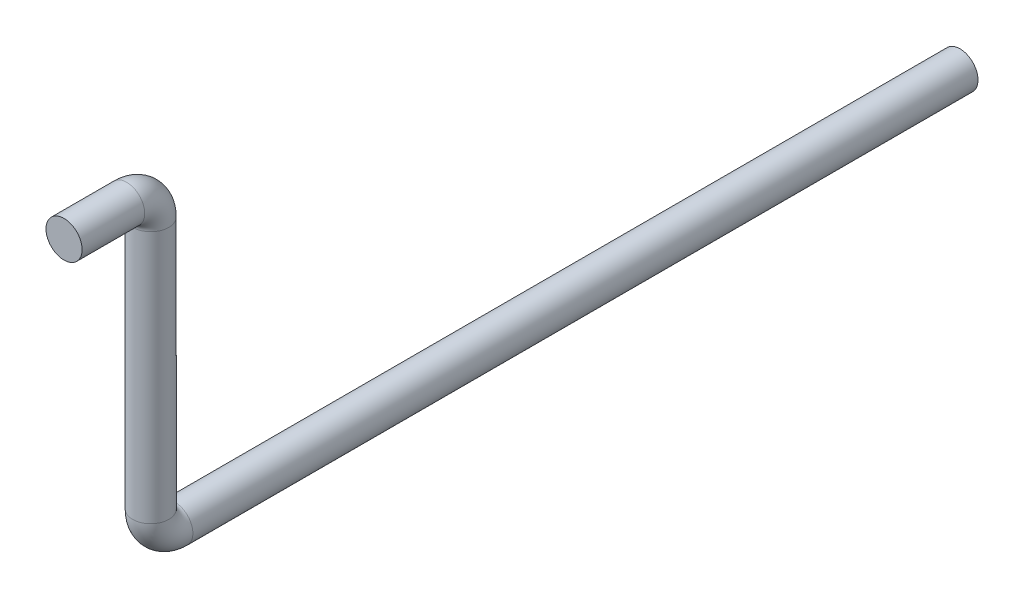
ISO-10303-21;
HEADER;
FILE_DESCRIPTION(('STEP AP214'),'2;1');
FILE_NAME('part.step','',(''),(''),'','','');
FILE_SCHEMA(('AUTOMOTIVE_DESIGN { 1 0 10303 214 1 1 1 1 }'));
ENDSEC;
DATA;
#1=APPLICATION_CONTEXT('core data for automotive mechanical design processes');
#2=APPLICATION_PROTOCOL_DEFINITION('international standard','automotive_design',2000,#1);
#3=PRODUCT_CONTEXT('',#1,'mechanical');
#4=PRODUCT('Part','Part','',(#3));
#5=PRODUCT_RELATED_PRODUCT_CATEGORY('part','',(#4));
#6=PRODUCT_DEFINITION_FORMATION('','',#4);
#7=PRODUCT_DEFINITION_CONTEXT('part definition',#1,'design');
#8=PRODUCT_DEFINITION('design','',#6,#7);
#9=PRODUCT_DEFINITION_SHAPE('','',#8);
#10=(LENGTH_UNIT() NAMED_UNIT(*) SI_UNIT(.MILLI.,.METRE.));
#11=(NAMED_UNIT(*) PLANE_ANGLE_UNIT() SI_UNIT($,.RADIAN.));
#12=(NAMED_UNIT(*) SI_UNIT($,.STERADIAN.) SOLID_ANGLE_UNIT());
#13=UNCERTAINTY_MEASURE_WITH_UNIT(LENGTH_MEASURE(1.E-05),#10,'distance_accuracy_value','');
#14=(GEOMETRIC_REPRESENTATION_CONTEXT(3) GLOBAL_UNCERTAINTY_ASSIGNED_CONTEXT((#13)) GLOBAL_UNIT_ASSIGNED_CONTEXT((#10,
#11,#12)) REPRESENTATION_CONTEXT('',''));
#15=CARTESIAN_POINT('',(0.,0.,0.));
#16=DIRECTION('',(0.,0.,1.));
#17=DIRECTION('',(1.,0.,0.));
#18=AXIS2_PLACEMENT_3D('',#15,#16,#17);
#19=CARTESIAN_POINT('',(4.69383318185996,140.15147983338,72.));
#20=DIRECTION('',(0.,0.,1.));
#21=DIRECTION('',(1.,0.,0.));
#22=AXIS2_PLACEMENT_3D('',#19,#20,#21);
#23=PLANE('',#22);
#24=CARTESIAN_POINT('',(4.69383318185996,140.15147983338,72.));
#25=DIRECTION('',(0.,0.,1.));
#26=DIRECTION('',(1.,0.,0.));
#27=AXIS2_PLACEMENT_3D('',#24,#25,#26);
#28=CIRCLE('',#27,7.5);
#29=CARTESIAN_POINT('',(12.19383318186,140.15147983338,72.));
#30=VERTEX_POINT('',#29);
#31=EDGE_CURVE('E11',#30,#30,#28,.T.);
#32=ORIENTED_EDGE('',*,*,#31,.T.);
#33=EDGE_LOOP('',(#32));
#34=FACE_BOUND('',#33,.T.);
#35=ADVANCED_FACE('F33',(#34),#23,.T.);
#36=CARTESIAN_POINT('',(4.69383318185996,15.1514798333803,0.));
#37=DIRECTION('',(0.,0.,1.));
#38=DIRECTION('',(1.,0.,0.));
#39=AXIS2_PLACEMENT_3D('',#36,#37,#38);
#40=CYLINDRICAL_SURFACE('',#39,7.5);
#41=CARTESIAN_POINT('',(4.69383318185996,15.1514798333803,26.));
#42=DIRECTION('',(0.,0.,1.));
#43=DIRECTION('',(1.,0.,0.));
#44=AXIS2_PLACEMENT_3D('',#41,#42,#43);
#45=CIRCLE('',#44,7.5);
#46=CARTESIAN_POINT('',(4.69383318185996,7.65147983338034,26.));
#47=VERTEX_POINT('',#46);
#48=EDGE_CURVE('E58',#47,#47,#45,.T.);
#49=ORIENTED_EDGE('',*,*,#48,.F.);
#50=EDGE_LOOP('',(#49));
#51=FACE_BOUND('',#50,.T.);
#52=CARTESIAN_POINT('',(4.69383318185996,15.1514798333803,-300.));
#53=DIRECTION('',(0.,0.,-1.));
#54=DIRECTION('',(-1.,0.,0.));
#55=AXIS2_PLACEMENT_3D('',#52,#53,#54);
#56=CIRCLE('',#55,7.5);
#57=CARTESIAN_POINT('',(-2.80616681814004,15.1514798333803,-300.));
#58=VERTEX_POINT('',#57);
#59=EDGE_CURVE('E61',#58,#58,#56,.T.);
#60=ORIENTED_EDGE('',*,*,#59,.F.);
#61=EDGE_LOOP('',(#60));
#62=FACE_BOUND('',#61,.T.);
#63=ADVANCED_FACE('F66',(#51,#62),#40,.T.);
#64=CARTESIAN_POINT('',(4.69383318185996,25.1514798333803,26.));
#65=DIRECTION('',(-1.,0.,0.));
#66=DIRECTION('',(0.,0.,1.));
#67=AXIS2_PLACEMENT_3D('',#64,#65,#66);
#68=TOROIDAL_SURFACE('',#67,10.,7.5);
#69=CARTESIAN_POINT('',(4.69383318185996,25.1514798333803,36.));
#70=DIRECTION('',(0.,1.,0.));
#71=DIRECTION('',(1.,0.,0.));
#72=AXIS2_PLACEMENT_3D('',#69,#70,#71);
#73=CIRCLE('',#72,7.5);
#74=CARTESIAN_POINT('',(4.69383318185996,25.1514798333803,43.5));
#75=VERTEX_POINT('',#74);
#76=EDGE_CURVE('E53',#75,#75,#73,.T.);
#77=CARTESIAN_POINT('',(4.69383318185996,25.1514798333803,26.));
#78=DIRECTION('',(-1.,0.,0.));
#79=DIRECTION('',(0.,0.,1.));
#80=AXIS2_PLACEMENT_3D('',#77,#78,#79);
#81=CIRCLE('',#80,17.5);
#82=EDGE_CURVE('',#47,#75,#81,.T.);
#83=ORIENTED_EDGE('',*,*,#48,.T.);
#84=ORIENTED_EDGE('',*,*,#76,.F.);
#85=ORIENTED_EDGE('',*,*,#82,.T.);
#86=ORIENTED_EDGE('',*,*,#82,.F.);
#87=EDGE_LOOP('',(#83,#85,#84,#86));
#88=FACE_BOUND('',#87,.T.);
#89=ADVANCED_FACE('F68',(#88),#68,.T.);
#90=CARTESIAN_POINT('',(4.69383318185996,25.1514798333803,36.));
#91=DIRECTION('',(0.,1.,0.));
#92=DIRECTION('',(0.,0.,1.));
#93=AXIS2_PLACEMENT_3D('',#90,#91,#92);
#94=CYLINDRICAL_SURFACE('',#93,7.5);
#95=CARTESIAN_POINT('',(4.69383318185996,130.15147983338,36.));
#96=DIRECTION('',(0.,1.,0.));
#97=DIRECTION('',(1.,0.,0.));
#98=AXIS2_PLACEMENT_3D('',#95,#96,#97);
#99=CIRCLE('',#98,7.5);
#100=CARTESIAN_POINT('',(4.69383318185996,130.15147983338,28.5));
#101=VERTEX_POINT('',#100);
#102=EDGE_CURVE('E51',#101,#101,#99,.T.);
#103=ORIENTED_EDGE('',*,*,#102,.F.);
#104=EDGE_LOOP('',(#103));
#105=FACE_BOUND('',#104,.T.);
#106=ORIENTED_EDGE('',*,*,#76,.T.);
#107=EDGE_LOOP('',(#106));
#108=FACE_BOUND('',#107,.T.);
#109=ADVANCED_FACE('F75',(#105,#108),#94,.T.);
#110=CARTESIAN_POINT('',(4.69383318185996,130.15147983338,46.));
#111=DIRECTION('',(1.,0.,0.));
#112=DIRECTION('',(0.,0.,-1.));
#113=AXIS2_PLACEMENT_3D('',#110,#111,#112);
#114=TOROIDAL_SURFACE('',#113,10.,7.5);
#115=CARTESIAN_POINT('',(4.69383318185996,140.15147983338,46.));
#116=DIRECTION('',(0.,0.,1.));
#117=DIRECTION('',(1.,0.,0.));
#118=AXIS2_PLACEMENT_3D('',#115,#116,#117);
#119=CIRCLE('',#118,7.5);
#120=CARTESIAN_POINT('',(4.69383318185996,147.65147983338,46.));
#121=VERTEX_POINT('',#120);
#122=EDGE_CURVE('E39',#121,#121,#119,.T.);
#123=CARTESIAN_POINT('',(4.69383318185996,130.15147983338,46.));
#124=DIRECTION('',(1.,0.,0.));
#125=DIRECTION('',(0.,0.,-1.));
#126=AXIS2_PLACEMENT_3D('',#123,#124,#125);
#127=CIRCLE('',#126,17.5);
#128=EDGE_CURVE('',#101,#121,#127,.T.);
#129=ORIENTED_EDGE('',*,*,#102,.T.);
#130=ORIENTED_EDGE('',*,*,#122,.F.);
#131=ORIENTED_EDGE('',*,*,#128,.T.);
#132=ORIENTED_EDGE('',*,*,#128,.F.);
#133=EDGE_LOOP('',(#129,#131,#130,#132));
#134=FACE_BOUND('',#133,.T.);
#135=ADVANCED_FACE('F47',(#134),#114,.T.);
#136=CARTESIAN_POINT('',(4.69383318185996,140.15147983338,46.));
#137=DIRECTION('',(0.,0.,1.));
#138=DIRECTION('',(1.,0.,0.));
#139=AXIS2_PLACEMENT_3D('',#136,#137,#138);
#140=CYLINDRICAL_SURFACE('',#139,7.5);
#141=ORIENTED_EDGE('',*,*,#31,.F.);
#142=EDGE_LOOP('',(#141));
#143=FACE_BOUND('',#142,.T.);
#144=ORIENTED_EDGE('',*,*,#122,.T.);
#145=EDGE_LOOP('',(#144));
#146=FACE_BOUND('',#145,.T.);
#147=ADVANCED_FACE('F43',(#143,#146),#140,.T.);
#148=CARTESIAN_POINT('',(4.69383318185996,15.1514798333803,-300.));
#149=DIRECTION('',(0.,0.,-1.));
#150=DIRECTION('',(-1.,0.,0.));
#151=AXIS2_PLACEMENT_3D('',#148,#149,#150);
#152=PLANE('',#151);
#153=ORIENTED_EDGE('',*,*,#59,.T.);
#154=EDGE_LOOP('',(#153));
#155=FACE_BOUND('',#154,.T.);
#156=ADVANCED_FACE('F46',(#155),#152,.T.);
#157=CLOSED_SHELL('',(#35,#63,#89,#109,#135,#147,#156));
#158=MANIFOLD_SOLID_BREP('B2',#157);
#159=ADVANCED_BREP_SHAPE_REPRESENTATION('',(#18,#158),#14);
#160=SHAPE_DEFINITION_REPRESENTATION(#9,#159);
ENDSEC;
END-ISO-10303-21;
